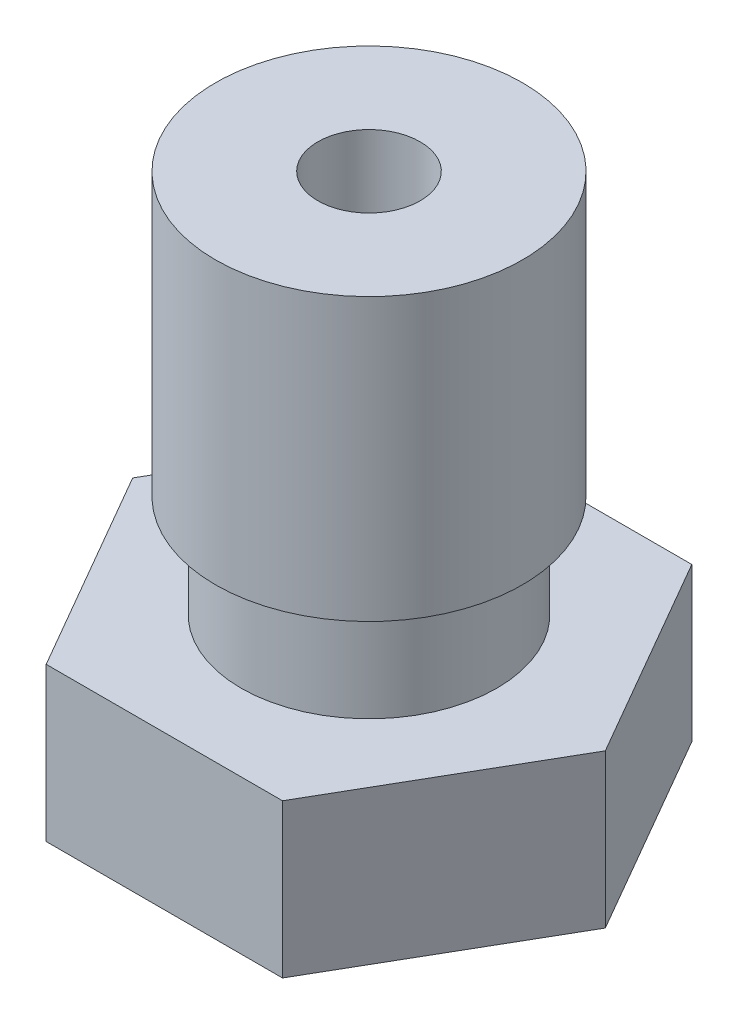
ISO-10303-21;
HEADER;
FILE_DESCRIPTION(('STEP AP214'),'2;1');
FILE_NAME('part.step','',(''),(''),'','','');
FILE_SCHEMA(('AUTOMOTIVE_DESIGN { 1 0 10303 214 1 1 1 1 }'));
ENDSEC;
DATA;
#1=APPLICATION_CONTEXT('core data for automotive mechanical design processes');
#2=APPLICATION_PROTOCOL_DEFINITION('international standard','automotive_design',2000,#1);
#3=PRODUCT_CONTEXT('',#1,'mechanical');
#4=PRODUCT('Part','Part','',(#3));
#5=PRODUCT_RELATED_PRODUCT_CATEGORY('part','',(#4));
#6=PRODUCT_DEFINITION_FORMATION('','',#4);
#7=PRODUCT_DEFINITION_CONTEXT('part definition',#1,'design');
#8=PRODUCT_DEFINITION('design','',#6,#7);
#9=PRODUCT_DEFINITION_SHAPE('','',#8);
#10=(LENGTH_UNIT() NAMED_UNIT(*) SI_UNIT(.MILLI.,.METRE.));
#11=(NAMED_UNIT(*) PLANE_ANGLE_UNIT() SI_UNIT($,.RADIAN.));
#12=(NAMED_UNIT(*) SI_UNIT($,.STERADIAN.) SOLID_ANGLE_UNIT());
#13=UNCERTAINTY_MEASURE_WITH_UNIT(LENGTH_MEASURE(1.E-05),#10,'distance_accuracy_value','');
#14=(GEOMETRIC_REPRESENTATION_CONTEXT(3) GLOBAL_UNCERTAINTY_ASSIGNED_CONTEXT((#13)) GLOBAL_UNIT_ASSIGNED_CONTEXT((#10,
#11,#12)) REPRESENTATION_CONTEXT('',''));
#15=CARTESIAN_POINT('',(0.,0.,0.));
#16=DIRECTION('',(0.,0.,1.));
#17=DIRECTION('',(1.,0.,0.));
#18=AXIS2_PLACEMENT_3D('',#15,#16,#17);
#19=CARTESIAN_POINT('',(0.,3.,0.));
#20=DIRECTION('',(0.,1.,0.));
#21=DIRECTION('',(0.,0.,1.));
#22=AXIS2_PLACEMENT_3D('',#19,#20,#21);
#23=PLANE('',#22);
#24=DIRECTION('',(-0.5,0.,-0.866025403784439));
#25=VECTOR('',#24,1.);
#26=CARTESIAN_POINT('',(4.61880215351701,3.,0.));
#27=LINE('',#26,#25);
#28=CARTESIAN_POINT('',(4.61880215351701,3.,0.));
#29=VERTEX_POINT('',#28);
#30=CARTESIAN_POINT('',(2.3094010767585,3.,-4.00000000000001));
#31=VERTEX_POINT('',#30);
#32=EDGE_CURVE('E130',#29,#31,#27,.T.);
#33=ORIENTED_EDGE('',*,*,#32,.T.);
#34=DIRECTION('',(-1.,0.,0.));
#35=VECTOR('',#34,1.);
#36=CARTESIAN_POINT('',(2.3094010767585,3.,-4.00000000000001));
#37=LINE('',#36,#35);
#38=CARTESIAN_POINT('',(-2.30940107675849,3.,-4.));
#39=VERTEX_POINT('',#38);
#40=EDGE_CURVE('E88',#31,#39,#37,.T.);
#41=ORIENTED_EDGE('',*,*,#40,.T.);
#42=DIRECTION('',(-0.5,0.,0.866025403784439));
#43=VECTOR('',#42,1.);
#44=CARTESIAN_POINT('',(-2.30940107675849,3.,-4.));
#45=LINE('',#44,#43);
#46=CARTESIAN_POINT('',(-4.618802153517,3.,0.));
#47=VERTEX_POINT('',#46);
#48=EDGE_CURVE('E101',#39,#47,#45,.T.);
#49=ORIENTED_EDGE('',*,*,#48,.T.);
#50=DIRECTION('',(0.5,0.,0.866025403784438));
#51=VECTOR('',#50,1.);
#52=CARTESIAN_POINT('',(-4.618802153517,3.,0.));
#53=LINE('',#52,#51);
#54=CARTESIAN_POINT('',(-2.3094010767585,3.,4.));
#55=VERTEX_POINT('',#54);
#56=EDGE_CURVE('E95',#47,#55,#53,.T.);
#57=ORIENTED_EDGE('',*,*,#56,.T.);
#58=DIRECTION('',(1.,0.,0.));
#59=VECTOR('',#58,1.);
#60=CARTESIAN_POINT('',(-2.3094010767585,3.,4.));
#61=LINE('',#60,#59);
#62=CARTESIAN_POINT('',(2.3094010767585,3.,4.));
#63=VERTEX_POINT('',#62);
#64=EDGE_CURVE('E99',#55,#63,#61,.T.);
#65=ORIENTED_EDGE('',*,*,#64,.T.);
#66=DIRECTION('',(0.5,0.,-0.866025403784439));
#67=VECTOR('',#66,1.);
#68=CARTESIAN_POINT('',(2.3094010767585,3.,4.));
#69=LINE('',#68,#67);
#70=EDGE_CURVE('E51',#63,#29,#69,.T.);
#71=ORIENTED_EDGE('',*,*,#70,.T.);
#72=EDGE_LOOP('',(#33,#41,#49,#57,#65,#71));
#73=FACE_BOUND('',#72,.T.);
#74=CARTESIAN_POINT('',(0.,3.,0.));
#75=DIRECTION('',(0.,-1.,0.));
#76=DIRECTION('',(0.,0.,-1.));
#77=AXIS2_PLACEMENT_3D('',#74,#75,#76);
#78=CIRCLE('',#77,2.5);
#79=CARTESIAN_POINT('',(0.,3.,-2.5));
#80=VERTEX_POINT('',#79);
#81=EDGE_CURVE('E216',#80,#80,#78,.T.);
#82=ORIENTED_EDGE('',*,*,#81,.T.);
#83=EDGE_LOOP('',(#82));
#84=FACE_BOUND('',#83,.T.);
#85=ADVANCED_FACE('F34',(#73,#84),#23,.T.);
#86=CARTESIAN_POINT('',(0.,0.,0.));
#87=DIRECTION('',(0.,1.,0.));
#88=DIRECTION('',(0.,0.,1.));
#89=AXIS2_PLACEMENT_3D('',#86,#87,#88);
#90=PLANE('',#89);
#91=CARTESIAN_POINT('',(0.,0.,0.));
#92=DIRECTION('',(0.,-1.,0.));
#93=DIRECTION('',(0.,0.,-1.));
#94=AXIS2_PLACEMENT_3D('',#91,#92,#93);
#95=CIRCLE('',#94,2.00041507641941);
#96=CARTESIAN_POINT('',(0.,0.,-2.00041507641941));
#97=VERTEX_POINT('',#96);
#98=EDGE_CURVE('E194',#97,#97,#95,.T.);
#99=ORIENTED_EDGE('',*,*,#98,.F.);
#100=EDGE_LOOP('',(#99));
#101=FACE_BOUND('',#100,.T.);
#102=DIRECTION('',(-0.5,0.,-0.866025403784439));
#103=VECTOR('',#102,1.);
#104=CARTESIAN_POINT('',(4.61880215351701,0.,0.));
#105=LINE('',#104,#103);
#106=CARTESIAN_POINT('',(4.61880215351701,0.,0.));
#107=VERTEX_POINT('',#106);
#108=CARTESIAN_POINT('',(2.3094010767585,0.,-4.00000000000001));
#109=VERTEX_POINT('',#108);
#110=EDGE_CURVE('E119',#107,#109,#105,.T.);
#111=ORIENTED_EDGE('',*,*,#110,.F.);
#112=DIRECTION('',(0.5,0.,-0.866025403784439));
#113=VECTOR('',#112,1.);
#114=CARTESIAN_POINT('',(2.3094010767585,0.,4.));
#115=LINE('',#114,#113);
#116=CARTESIAN_POINT('',(2.3094010767585,0.,4.));
#117=VERTEX_POINT('',#116);
#118=EDGE_CURVE('E80',#117,#107,#115,.T.);
#119=ORIENTED_EDGE('',*,*,#118,.F.);
#120=DIRECTION('',(1.,0.,0.));
#121=VECTOR('',#120,1.);
#122=CARTESIAN_POINT('',(-2.3094010767585,0.,4.));
#123=LINE('',#122,#121);
#124=CARTESIAN_POINT('',(-2.3094010767585,0.,4.));
#125=VERTEX_POINT('',#124);
#126=EDGE_CURVE('E74',#125,#117,#123,.T.);
#127=ORIENTED_EDGE('',*,*,#126,.F.);
#128=DIRECTION('',(0.5,0.,0.866025403784438));
#129=VECTOR('',#128,1.);
#130=CARTESIAN_POINT('',(-4.618802153517,0.,0.));
#131=LINE('',#130,#129);
#132=CARTESIAN_POINT('',(-4.618802153517,0.,0.));
#133=VERTEX_POINT('',#132);
#134=EDGE_CURVE('E109',#133,#125,#131,.T.);
#135=ORIENTED_EDGE('',*,*,#134,.F.);
#136=DIRECTION('',(-0.5,0.,0.866025403784439));
#137=VECTOR('',#136,1.);
#138=CARTESIAN_POINT('',(-2.30940107675849,0.,-4.));
#139=LINE('',#138,#137);
#140=CARTESIAN_POINT('',(-2.30940107675849,0.,-4.));
#141=VERTEX_POINT('',#140);
#142=EDGE_CURVE('E125',#141,#133,#139,.T.);
#143=ORIENTED_EDGE('',*,*,#142,.F.);
#144=DIRECTION('',(-1.,0.,0.));
#145=VECTOR('',#144,1.);
#146=CARTESIAN_POINT('',(2.3094010767585,0.,-4.00000000000001));
#147=LINE('',#146,#145);
#148=EDGE_CURVE('E122',#109,#141,#147,.T.);
#149=ORIENTED_EDGE('',*,*,#148,.F.);
#150=EDGE_LOOP('',(#111,#119,#127,#135,#143,#149));
#151=FACE_BOUND('',#150,.T.);
#152=ADVANCED_FACE('F139',(#101,#151),#90,.F.);
#153=CARTESIAN_POINT('',(4.61880215351701,3.,0.));
#154=DIRECTION('',(-0.866025403784439,0.,0.5));
#155=DIRECTION('',(0.5,0.,0.866025403784439));
#156=AXIS2_PLACEMENT_3D('',#153,#154,#155);
#157=PLANE('',#156);
#158=ORIENTED_EDGE('',*,*,#110,.T.);
#159=DIRECTION('',(0.,-1.,0.));
#160=VECTOR('',#159,1.);
#161=CARTESIAN_POINT('',(2.3094010767585,3.,-4.00000000000001));
#162=LINE('',#161,#160);
#163=EDGE_CURVE('E11',#31,#109,#162,.T.);
#164=ORIENTED_EDGE('',*,*,#163,.F.);
#165=ORIENTED_EDGE('',*,*,#32,.F.);
#166=DIRECTION('',(0.,-1.,0.));
#167=VECTOR('',#166,1.);
#168=CARTESIAN_POINT('',(4.61880215351701,3.,0.));
#169=LINE('',#168,#167);
#170=EDGE_CURVE('E115',#29,#107,#169,.T.);
#171=ORIENTED_EDGE('',*,*,#170,.T.);
#172=EDGE_LOOP('',(#158,#164,#165,#171));
#173=FACE_BOUND('',#172,.T.);
#174=ADVANCED_FACE('F36',(#173),#157,.F.);
#175=CARTESIAN_POINT('',(2.3094010767585,3.,-4.00000000000001));
#176=DIRECTION('',(0.,0.,1.));
#177=DIRECTION('',(1.,0.,0.));
#178=AXIS2_PLACEMENT_3D('',#175,#176,#177);
#179=PLANE('',#178);
#180=ORIENTED_EDGE('',*,*,#148,.T.);
#181=DIRECTION('',(0.,-1.,0.));
#182=VECTOR('',#181,1.);
#183=CARTESIAN_POINT('',(-2.30940107675849,3.,-4.));
#184=LINE('',#183,#182);
#185=EDGE_CURVE('E43',#39,#141,#184,.T.);
#186=ORIENTED_EDGE('',*,*,#185,.F.);
#187=ORIENTED_EDGE('',*,*,#40,.F.);
#188=ORIENTED_EDGE('',*,*,#163,.T.);
#189=EDGE_LOOP('',(#180,#186,#187,#188));
#190=FACE_BOUND('',#189,.T.);
#191=ADVANCED_FACE('F304',(#190),#179,.F.);
#192=CARTESIAN_POINT('',(-2.30940107675849,3.,-4.));
#193=DIRECTION('',(0.866025403784439,0.,0.5));
#194=DIRECTION('',(0.5,0.,-0.866025403784439));
#195=AXIS2_PLACEMENT_3D('',#192,#193,#194);
#196=PLANE('',#195);
#197=ORIENTED_EDGE('',*,*,#142,.T.);
#198=DIRECTION('',(0.,-1.,0.));
#199=VECTOR('',#198,1.);
#200=CARTESIAN_POINT('',(-4.618802153517,3.,0.));
#201=LINE('',#200,#199);
#202=EDGE_CURVE('E110',#47,#133,#201,.T.);
#203=ORIENTED_EDGE('',*,*,#202,.F.);
#204=ORIENTED_EDGE('',*,*,#48,.F.);
#205=ORIENTED_EDGE('',*,*,#185,.T.);
#206=EDGE_LOOP('',(#197,#203,#204,#205));
#207=FACE_BOUND('',#206,.T.);
#208=ADVANCED_FACE('F136',(#207),#196,.F.);
#209=CARTESIAN_POINT('',(-4.618802153517,3.,0.));
#210=DIRECTION('',(0.866025403784439,0.,-0.5));
#211=DIRECTION('',(-0.5,0.,-0.866025403784439));
#212=AXIS2_PLACEMENT_3D('',#209,#210,#211);
#213=PLANE('',#212);
#214=ORIENTED_EDGE('',*,*,#134,.T.);
#215=DIRECTION('',(0.,-1.,0.));
#216=VECTOR('',#215,1.);
#217=CARTESIAN_POINT('',(-2.3094010767585,3.,4.));
#218=LINE('',#217,#216);
#219=EDGE_CURVE('E106',#55,#125,#218,.T.);
#220=ORIENTED_EDGE('',*,*,#219,.F.);
#221=ORIENTED_EDGE('',*,*,#56,.F.);
#222=ORIENTED_EDGE('',*,*,#202,.T.);
#223=EDGE_LOOP('',(#214,#220,#221,#222));
#224=FACE_BOUND('',#223,.T.);
#225=ADVANCED_FACE('F107',(#224),#213,.F.);
#226=CARTESIAN_POINT('',(-2.3094010767585,3.,4.));
#227=DIRECTION('',(0.,0.,-1.));
#228=DIRECTION('',(-1.,0.,0.));
#229=AXIS2_PLACEMENT_3D('',#226,#227,#228);
#230=PLANE('',#229);
#231=ORIENTED_EDGE('',*,*,#126,.T.);
#232=DIRECTION('',(0.,-1.,0.));
#233=VECTOR('',#232,1.);
#234=CARTESIAN_POINT('',(2.3094010767585,3.,4.));
#235=LINE('',#234,#233);
#236=EDGE_CURVE('E111',#63,#117,#235,.T.);
#237=ORIENTED_EDGE('',*,*,#236,.F.);
#238=ORIENTED_EDGE('',*,*,#64,.F.);
#239=ORIENTED_EDGE('',*,*,#219,.T.);
#240=EDGE_LOOP('',(#231,#237,#238,#239));
#241=FACE_BOUND('',#240,.T.);
#242=ADVANCED_FACE('F113',(#241),#230,.F.);
#243=CARTESIAN_POINT('',(2.3094010767585,3.,4.));
#244=DIRECTION('',(-0.866025403784439,0.,-0.5));
#245=DIRECTION('',(-0.5,0.,0.866025403784439));
#246=AXIS2_PLACEMENT_3D('',#243,#244,#245);
#247=PLANE('',#246);
#248=ORIENTED_EDGE('',*,*,#118,.T.);
#249=ORIENTED_EDGE('',*,*,#170,.F.);
#250=ORIENTED_EDGE('',*,*,#70,.F.);
#251=ORIENTED_EDGE('',*,*,#236,.T.);
#252=EDGE_LOOP('',(#248,#249,#250,#251));
#253=FACE_BOUND('',#252,.T.);
#254=ADVANCED_FACE('F143',(#253),#247,.F.);
#255=CARTESIAN_POINT('',(0.,3.,0.));
#256=DIRECTION('',(0.,-1.,0.));
#257=DIRECTION('',(0.,0.,-1.));
#258=AXIS2_PLACEMENT_3D('',#255,#256,#257);
#259=CYLINDRICAL_SURFACE('',#258,1.);
#260=CARTESIAN_POINT('',(0.,0.,0.));
#261=DIRECTION('',(0.,1.,0.));
#262=DIRECTION('',(0.,0.,1.));
#263=AXIS2_PLACEMENT_3D('',#260,#261,#262);
#264=CIRCLE('',#263,1.);
#265=CARTESIAN_POINT('',(0.,0.,1.));
#266=VERTEX_POINT('',#265);
#267=EDGE_CURVE('E123',#266,#266,#264,.T.);
#268=ORIENTED_EDGE('',*,*,#267,.F.);
#269=EDGE_LOOP('',(#268));
#270=FACE_BOUND('',#269,.T.);
#271=CARTESIAN_POINT('',(0.,10.5,0.));
#272=DIRECTION('',(0.,-1.,0.));
#273=DIRECTION('',(0.,0.,-1.));
#274=AXIS2_PLACEMENT_3D('',#271,#272,#273);
#275=CIRCLE('',#274,1.);
#276=CARTESIAN_POINT('',(0.,10.5,-1.));
#277=VERTEX_POINT('',#276);
#278=EDGE_CURVE('E201',#277,#277,#275,.T.);
#279=ORIENTED_EDGE('',*,*,#278,.F.);
#280=EDGE_LOOP('',(#279));
#281=FACE_BOUND('',#280,.T.);
#282=ADVANCED_FACE('F145',(#270,#281),#259,.F.);
#283=CARTESIAN_POINT('',(0.,-2.,0.));
#284=DIRECTION('',(0.,-1.,0.));
#285=DIRECTION('',(0.,0.,-1.));
#286=AXIS2_PLACEMENT_3D('',#283,#284,#285);
#287=CYLINDRICAL_SURFACE('',#286,2.5);
#288=ORIENTED_EDGE('',*,*,#81,.F.);
#289=EDGE_LOOP('',(#288));
#290=FACE_BOUND('',#289,.T.);
#291=CARTESIAN_POINT('',(0.,5.,0.));
#292=DIRECTION('',(0.,-1.,0.));
#293=DIRECTION('',(0.,0.,-1.));
#294=AXIS2_PLACEMENT_3D('',#291,#292,#293);
#295=CIRCLE('',#294,2.5);
#296=CARTESIAN_POINT('',(0.,5.,-2.5));
#297=VERTEX_POINT('',#296);
#298=EDGE_CURVE('E213',#297,#297,#295,.T.);
#299=ORIENTED_EDGE('',*,*,#298,.T.);
#300=EDGE_LOOP('',(#299));
#301=FACE_BOUND('',#300,.T.);
#302=ADVANCED_FACE('F151',(#290,#301),#287,.T.);
#303=CARTESIAN_POINT('',(0.,5.,0.));
#304=DIRECTION('',(0.,1.,0.));
#305=DIRECTION('',(0.,0.,1.));
#306=AXIS2_PLACEMENT_3D('',#303,#304,#305);
#307=PLANE('',#306);
#308=ORIENTED_EDGE('',*,*,#298,.F.);
#309=EDGE_LOOP('',(#308));
#310=FACE_BOUND('',#309,.T.);
#311=CARTESIAN_POINT('',(0.,5.,0.));
#312=DIRECTION('',(0.,-1.,0.));
#313=DIRECTION('',(0.,0.,-1.));
#314=AXIS2_PLACEMENT_3D('',#311,#312,#313);
#315=CIRCLE('',#314,3.);
#316=CARTESIAN_POINT('',(0.,5.,-3.));
#317=VERTEX_POINT('',#316);
#318=EDGE_CURVE('E210',#317,#317,#315,.T.);
#319=ORIENTED_EDGE('',*,*,#318,.T.);
#320=EDGE_LOOP('',(#319));
#321=FACE_BOUND('',#320,.T.);
#322=ADVANCED_FACE('F165',(#310,#321),#307,.F.);
#323=CARTESIAN_POINT('',(0.,-2.,0.));
#324=DIRECTION('',(0.,-1.,0.));
#325=DIRECTION('',(0.,0.,-1.));
#326=AXIS2_PLACEMENT_3D('',#323,#324,#325);
#327=CYLINDRICAL_SURFACE('',#326,3.);
#328=ORIENTED_EDGE('',*,*,#318,.F.);
#329=EDGE_LOOP('',(#328));
#330=FACE_BOUND('',#329,.T.);
#331=CARTESIAN_POINT('',(0.,10.5,0.));
#332=DIRECTION('',(0.,-1.,0.));
#333=DIRECTION('',(0.,0.,-1.));
#334=AXIS2_PLACEMENT_3D('',#331,#332,#333);
#335=CIRCLE('',#334,3.);
#336=CARTESIAN_POINT('',(0.,10.5,-3.));
#337=VERTEX_POINT('',#336);
#338=EDGE_CURVE('E207',#337,#337,#335,.T.);
#339=ORIENTED_EDGE('',*,*,#338,.T.);
#340=EDGE_LOOP('',(#339));
#341=FACE_BOUND('',#340,.T.);
#342=ADVANCED_FACE('F169',(#330,#341),#327,.T.);
#343=CARTESIAN_POINT('',(0.,10.5,0.));
#344=DIRECTION('',(0.,-1.,0.));
#345=DIRECTION('',(0.,0.,-1.));
#346=AXIS2_PLACEMENT_3D('',#343,#344,#345);
#347=PLANE('',#346);
#348=ORIENTED_EDGE('',*,*,#338,.F.);
#349=EDGE_LOOP('',(#348));
#350=FACE_BOUND('',#349,.T.);
#351=ORIENTED_EDGE('',*,*,#278,.T.);
#352=EDGE_LOOP('',(#351));
#353=FACE_BOUND('',#352,.T.);
#354=ADVANCED_FACE('F173',(#350,#353),#347,.F.);
#355=CARTESIAN_POINT('',(0.,0.,0.));
#356=DIRECTION('',(0.,1.,0.));
#357=DIRECTION('',(0.,0.,1.));
#358=AXIS2_PLACEMENT_3D('',#355,#356,#357);
#359=CONICAL_SURFACE('',#358,1.,0.369684288795301);
#360=CARTESIAN_POINT('',(0.,-2.,0.));
#361=DIRECTION('',(0.,-1.,0.));
#362=DIRECTION('',(0.,0.,-1.));
#363=AXIS2_PLACEMENT_3D('',#360,#361,#362);
#364=CIRCLE('',#363,0.225);
#365=CARTESIAN_POINT('',(0.,-2.,-0.225));
#366=VERTEX_POINT('',#365);
#367=EDGE_CURVE('E198',#366,#366,#364,.T.);
#368=ORIENTED_EDGE('',*,*,#367,.T.);
#369=EDGE_LOOP('',(#368));
#370=FACE_BOUND('',#369,.T.);
#371=ORIENTED_EDGE('',*,*,#267,.T.);
#372=EDGE_LOOP('',(#371));
#373=FACE_BOUND('',#372,.T.);
#374=ADVANCED_FACE('F177',(#370,#373),#359,.F.);
#375=CARTESIAN_POINT('',(0.,-2.,0.));
#376=DIRECTION('',(0.,-1.,0.));
#377=DIRECTION('',(0.,0.,-1.));
#378=AXIS2_PLACEMENT_3D('',#375,#376,#377);
#379=PLANE('',#378);
#380=CARTESIAN_POINT('',(0.,-2.,0.));
#381=DIRECTION('',(0.,-1.,0.));
#382=DIRECTION('',(0.,0.,-1.));
#383=AXIS2_PLACEMENT_3D('',#380,#381,#382);
#384=CIRCLE('',#383,0.6);
#385=CARTESIAN_POINT('',(0.,-2.,-0.6));
#386=VERTEX_POINT('',#385);
#387=EDGE_CURVE('E197',#386,#386,#384,.T.);
#388=ORIENTED_EDGE('',*,*,#387,.T.);
#389=EDGE_LOOP('',(#388));
#390=FACE_BOUND('',#389,.T.);
#391=ORIENTED_EDGE('',*,*,#367,.F.);
#392=EDGE_LOOP('',(#391));
#393=FACE_BOUND('',#392,.T.);
#394=ADVANCED_FACE('F181',(#390,#393),#379,.T.);
#395=CARTESIAN_POINT('',(0.,-2.,0.));
#396=DIRECTION('',(0.,1.,0.));
#397=DIRECTION('',(0.,0.,1.));
#398=AXIS2_PLACEMENT_3D('',#395,#396,#397);
#399=CONICAL_SURFACE('',#398,0.6,0.610865238198013);
#400=ORIENTED_EDGE('',*,*,#98,.T.);
#401=EDGE_LOOP('',(#400));
#402=FACE_BOUND('',#401,.T.);
#403=ORIENTED_EDGE('',*,*,#387,.F.);
#404=EDGE_LOOP('',(#403));
#405=FACE_BOUND('',#404,.T.);
#406=ADVANCED_FACE('F185',(#402,#405),#399,.T.);
#407=CLOSED_SHELL('',(#85,#152,#174,#191,#208,#225,#242,#254,#282,#302,#322,#342,#354,#374,#394,#406));
#408=MANIFOLD_SOLID_BREP('B2',#407);
#409=ADVANCED_BREP_SHAPE_REPRESENTATION('',(#18,#408),#14);
#410=SHAPE_DEFINITION_REPRESENTATION(#9,#409);
ENDSEC;
END-ISO-10303-21;
